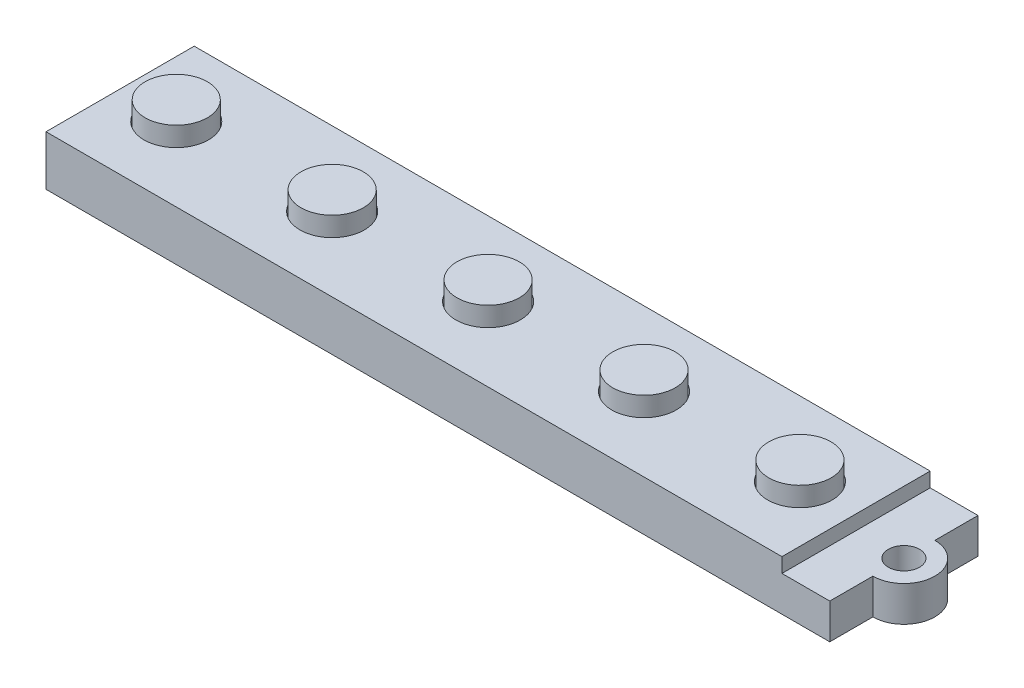
ISO-10303-21;
HEADER;
FILE_DESCRIPTION(('STEP AP214'),'2;1');
FILE_NAME('part.step','',(''),(''),'','','');
FILE_SCHEMA(('AUTOMOTIVE_DESIGN { 1 0 10303 214 1 1 1 1 }'));
ENDSEC;
DATA;
#1=APPLICATION_CONTEXT('core data for automotive mechanical design processes');
#2=APPLICATION_PROTOCOL_DEFINITION('international standard','automotive_design',2000,#1);
#3=PRODUCT_CONTEXT('',#1,'mechanical');
#4=PRODUCT('Part','Part','',(#3));
#5=PRODUCT_RELATED_PRODUCT_CATEGORY('part','',(#4));
#6=PRODUCT_DEFINITION_FORMATION('','',#4);
#7=PRODUCT_DEFINITION_CONTEXT('part definition',#1,'design');
#8=PRODUCT_DEFINITION('design','',#6,#7);
#9=PRODUCT_DEFINITION_SHAPE('','',#8);
#10=(LENGTH_UNIT() NAMED_UNIT(*) SI_UNIT(.MILLI.,.METRE.));
#11=(NAMED_UNIT(*) PLANE_ANGLE_UNIT() SI_UNIT($,.RADIAN.));
#12=(NAMED_UNIT(*) SI_UNIT($,.STERADIAN.) SOLID_ANGLE_UNIT());
#13=UNCERTAINTY_MEASURE_WITH_UNIT(LENGTH_MEASURE(1.E-05),#10,'distance_accuracy_value','');
#14=(GEOMETRIC_REPRESENTATION_CONTEXT(3) GLOBAL_UNCERTAINTY_ASSIGNED_CONTEXT((#13)) GLOBAL_UNIT_ASSIGNED_CONTEXT((#10,
#11,#12)) REPRESENTATION_CONTEXT('',''));
#15=CARTESIAN_POINT('',(0.,0.,0.));
#16=DIRECTION('',(0.,0.,1.));
#17=DIRECTION('',(1.,0.,0.));
#18=AXIS2_PLACEMENT_3D('',#15,#16,#17);
#19=CARTESIAN_POINT('',(0.,0.,0.));
#20=DIRECTION('',(0.,1.,0.));
#21=DIRECTION('',(0.,0.,1.));
#22=AXIS2_PLACEMENT_3D('',#19,#20,#21);
#23=PLANE('',#22);
#24=CARTESIAN_POINT('',(-20.4046666666667,0.,-25.8942737373737));
#25=DIRECTION('',(0.,1.,0.));
#26=DIRECTION('',(0.,0.,1.));
#27=AXIS2_PLACEMENT_3D('',#24,#25,#26);
#28=CIRCLE('',#27,1.905);
#29=CARTESIAN_POINT('',(-20.4046666666667,0.,-23.9892737373737));
#30=VERTEX_POINT('',#29);
#31=EDGE_CURVE('E223',#30,#30,#28,.T.);
#32=ORIENTED_EDGE('',*,*,#31,.T.);
#33=EDGE_LOOP('',(#32));
#34=FACE_BOUND('',#33,.T.);
#35=DIRECTION('',(0.,0.,-1.));
#36=VECTOR('',#35,1.);
#37=CARTESIAN_POINT('',(-112.479666666667,0.,-32.2442737373737));
#38=LINE('',#37,#36);
#39=CARTESIAN_POINT('',(-112.479666666667,0.,-19.5442737373737));
#40=VERTEX_POINT('',#39);
#41=CARTESIAN_POINT('',(-112.479666666667,0.,-32.2442737373737));
#42=VERTEX_POINT('',#41);
#43=EDGE_CURVE('E162',#40,#42,#38,.T.);
#44=ORIENTED_EDGE('',*,*,#43,.F.);
#45=DIRECTION('',(-1.,0.,0.));
#46=VECTOR('',#45,1.);
#47=CARTESIAN_POINT('',(-29.9296666666666,0.,-19.5442737373737));
#48=LINE('',#47,#46);
#49=CARTESIAN_POINT('',(-29.9296666666666,0.,-19.5442737373737));
#50=VERTEX_POINT('',#49);
#51=EDGE_CURVE('E167',#50,#40,#48,.T.);
#52=ORIENTED_EDGE('',*,*,#51,.F.);
#53=DIRECTION('',(0.,0.,1.));
#54=VECTOR('',#53,1.);
#55=CARTESIAN_POINT('',(-29.9296666666666,0.,-32.2442737373737));
#56=LINE('',#55,#54);
#57=CARTESIAN_POINT('',(-29.9296666666666,0.,-32.2442737373737));
#58=VERTEX_POINT('',#57);
#59=EDGE_CURVE('E177',#58,#50,#56,.T.);
#60=ORIENTED_EDGE('',*,*,#59,.F.);
#61=DIRECTION('',(1.,0.,0.));
#62=VECTOR('',#61,1.);
#63=CARTESIAN_POINT('',(-29.9296666666666,0.,-32.2442737373737));
#64=LINE('',#63,#62);
#65=EDGE_CURVE('E60',#42,#58,#64,.T.);
#66=ORIENTED_EDGE('',*,*,#65,.F.);
#67=EDGE_LOOP('',(#44,#52,#60,#66));
#68=FACE_BOUND('',#67,.T.);
#69=DIRECTION('',(-1.,0.,0.));
#70=VECTOR('',#69,1.);
#71=CARTESIAN_POINT('',(-116.162666666667,0.,-34.9493737373737));
#72=LINE('',#71,#70);
#73=CARTESIAN_POINT('',(-20.4046666666667,0.,-34.9493737373737));
#74=VERTEX_POINT('',#73);
#75=CARTESIAN_POINT('',(-116.162666666667,0.,-34.9493737373737));
#76=VERTEX_POINT('',#75);
#77=EDGE_CURVE('E245',#74,#76,#72,.T.);
#78=ORIENTED_EDGE('',*,*,#77,.F.);
#79=DIRECTION('',(0.,0.,1.));
#80=VECTOR('',#79,1.);
#81=CARTESIAN_POINT('',(-20.4046666666667,0.,0.));
#82=LINE('',#81,#80);
#83=CARTESIAN_POINT('',(-20.4046666666667,0.,-29.6800450522713));
#84=VERTEX_POINT('',#83);
#85=EDGE_CURVE('E159',#74,#84,#82,.T.);
#86=ORIENTED_EDGE('',*,*,#85,.T.);
#87=CARTESIAN_POINT('',(-20.4046666666667,0.,-25.8942737373737));
#88=DIRECTION('',(0.,1.,0.));
#89=DIRECTION('',(0.,0.,1.));
#90=AXIS2_PLACEMENT_3D('',#87,#88,#89);
#91=CIRCLE('',#90,3.78577131489756);
#92=CARTESIAN_POINT('',(-20.4046666666667,0.,-22.1085024224762));
#93=VERTEX_POINT('',#92);
#94=EDGE_CURVE('E155',#84,#93,#91,.F.);
#95=ORIENTED_EDGE('',*,*,#94,.T.);
#96=DIRECTION('',(0.,0.,1.));
#97=VECTOR('',#96,1.);
#98=CARTESIAN_POINT('',(-20.4046666666666,0.,0.));
#99=LINE('',#98,#97);
#100=CARTESIAN_POINT('',(-20.4046666666666,0.,-16.8391737373737));
#101=VERTEX_POINT('',#100);
#102=EDGE_CURVE('E133',#93,#101,#99,.T.);
#103=ORIENTED_EDGE('',*,*,#102,.T.);
#104=DIRECTION('',(1.,0.,0.));
#105=VECTOR('',#104,1.);
#106=CARTESIAN_POINT('',(-116.162666666667,0.,-16.8391737373737));
#107=LINE('',#106,#105);
#108=CARTESIAN_POINT('',(-116.162666666667,0.,-16.8391737373737));
#109=VERTEX_POINT('',#108);
#110=EDGE_CURVE('E252',#109,#101,#107,.T.);
#111=ORIENTED_EDGE('',*,*,#110,.F.);
#112=DIRECTION('',(0.,0.,1.));
#113=VECTOR('',#112,1.);
#114=CARTESIAN_POINT('',(-116.162666666667,0.,-34.9493737373737));
#115=LINE('',#114,#113);
#116=EDGE_CURVE('E238',#76,#109,#115,.T.);
#117=ORIENTED_EDGE('',*,*,#116,.F.);
#118=EDGE_LOOP('',(#78,#86,#95,#103,#111,#117));
#119=FACE_BOUND('',#118,.T.);
#120=ADVANCED_FACE('F37',(#34,#68,#119),#23,.F.);
#121=CARTESIAN_POINT('',(0.,4.318,0.));
#122=DIRECTION('',(0.,1.,0.));
#123=DIRECTION('',(0.,0.,1.));
#124=AXIS2_PLACEMENT_3D('',#121,#122,#123);
#125=PLANE('',#124);
#126=CARTESIAN_POINT('',(-20.4046666666667,4.318,-25.8942737373737));
#127=DIRECTION('',(0.,1.,0.));
#128=DIRECTION('',(0.,0.,1.));
#129=AXIS2_PLACEMENT_3D('',#126,#127,#128);
#130=CIRCLE('',#129,1.905);
#131=CARTESIAN_POINT('',(-20.4046666666667,4.318,-23.9892737373737));
#132=VERTEX_POINT('',#131);
#133=EDGE_CURVE('E220',#132,#132,#130,.T.);
#134=ORIENTED_EDGE('',*,*,#133,.F.);
#135=EDGE_LOOP('',(#134));
#136=FACE_BOUND('',#135,.T.);
#137=DIRECTION('',(0.,0.,1.));
#138=VECTOR('',#137,1.);
#139=CARTESIAN_POINT('',(-20.4046666666667,4.318,-34.9493737373737));
#140=LINE('',#139,#138);
#141=CARTESIAN_POINT('',(-20.4046666666667,4.318,-34.9493737373737));
#142=VERTEX_POINT('',#141);
#143=CARTESIAN_POINT('',(-20.4046666666667,4.318,-29.6800450522713));
#144=VERTEX_POINT('',#143);
#145=EDGE_CURVE('E52',#142,#144,#140,.T.);
#146=ORIENTED_EDGE('',*,*,#145,.F.);
#147=DIRECTION('',(-1.,0.,0.));
#148=VECTOR('',#147,1.);
#149=CARTESIAN_POINT('',(-26.2466666666667,4.318,-34.9493737373737));
#150=LINE('',#149,#148);
#151=CARTESIAN_POINT('',(-26.2466666666667,4.318,-34.9493737373737));
#152=VERTEX_POINT('',#151);
#153=EDGE_CURVE('E232',#142,#152,#150,.T.);
#154=ORIENTED_EDGE('',*,*,#153,.T.);
#155=DIRECTION('',(0.,0.,1.));
#156=VECTOR('',#155,1.);
#157=CARTESIAN_POINT('',(-26.2466666666667,4.318,-34.9493737373737));
#158=LINE('',#157,#156);
#159=CARTESIAN_POINT('',(-26.2466666666667,4.318,-16.8391737373737));
#160=VERTEX_POINT('',#159);
#161=EDGE_CURVE('E229',#152,#160,#158,.T.);
#162=ORIENTED_EDGE('',*,*,#161,.T.);
#163=DIRECTION('',(1.,0.,0.));
#164=VECTOR('',#163,1.);
#165=CARTESIAN_POINT('',(-26.2466666666667,4.318,-16.8391737373737));
#166=LINE('',#165,#164);
#167=CARTESIAN_POINT('',(-20.4046666666666,4.318,-16.8391737373737));
#168=VERTEX_POINT('',#167);
#169=EDGE_CURVE('E148',#160,#168,#166,.T.);
#170=ORIENTED_EDGE('',*,*,#169,.T.);
#171=DIRECTION('',(0.,0.,1.));
#172=VECTOR('',#171,1.);
#173=CARTESIAN_POINT('',(-20.4046666666667,4.318,-22.1085024224762));
#174=LINE('',#173,#172);
#175=CARTESIAN_POINT('',(-20.4046666666667,4.318,-22.1085024224762));
#176=VERTEX_POINT('',#175);
#177=EDGE_CURVE('E130',#176,#168,#174,.T.);
#178=ORIENTED_EDGE('',*,*,#177,.F.);
#179=CARTESIAN_POINT('',(-20.4046666666667,4.318,-25.8942737373737));
#180=DIRECTION('',(0.,-1.,0.));
#181=DIRECTION('',(0.,0.,1.));
#182=AXIS2_PLACEMENT_3D('',#179,#180,#181);
#183=CIRCLE('',#182,3.78577131489756);
#184=EDGE_CURVE('E140',#144,#176,#183,.T.);
#185=ORIENTED_EDGE('',*,*,#184,.F.);
#186=EDGE_LOOP('',(#146,#154,#162,#170,#178,#185));
#187=FACE_BOUND('',#186,.T.);
#188=ADVANCED_FACE('F145',(#136,#187),#125,.T.);
#189=CARTESIAN_POINT('',(-116.162666666667,6.096,-34.9493737373737));
#190=DIRECTION('',(1.,0.,0.));
#191=DIRECTION('',(0.,0.,-1.));
#192=AXIS2_PLACEMENT_3D('',#189,#190,#191);
#193=PLANE('',#192);
#194=ORIENTED_EDGE('',*,*,#116,.T.);
#195=DIRECTION('',(0.,-1.,0.));
#196=VECTOR('',#195,1.);
#197=CARTESIAN_POINT('',(-116.162666666667,6.096,-16.8391737373737));
#198=LINE('',#197,#196);
#199=CARTESIAN_POINT('',(-116.162666666667,6.096,-16.8391737373737));
#200=VERTEX_POINT('',#199);
#201=EDGE_CURVE('E11',#200,#109,#198,.T.);
#202=ORIENTED_EDGE('',*,*,#201,.F.);
#203=DIRECTION('',(0.,0.,1.));
#204=VECTOR('',#203,1.);
#205=CARTESIAN_POINT('',(-116.162666666667,6.096,-34.9493737373737));
#206=LINE('',#205,#204);
#207=CARTESIAN_POINT('',(-116.162666666667,6.096,-34.9493737373737));
#208=VERTEX_POINT('',#207);
#209=EDGE_CURVE('E241',#208,#200,#206,.T.);
#210=ORIENTED_EDGE('',*,*,#209,.F.);
#211=DIRECTION('',(0.,-1.,0.));
#212=VECTOR('',#211,1.);
#213=CARTESIAN_POINT('',(-116.162666666667,6.096,-34.9493737373737));
#214=LINE('',#213,#212);
#215=EDGE_CURVE('E45',#208,#76,#214,.T.);
#216=ORIENTED_EDGE('',*,*,#215,.T.);
#217=EDGE_LOOP('',(#194,#202,#210,#216));
#218=FACE_BOUND('',#217,.T.);
#219=ADVANCED_FACE('F39',(#218),#193,.F.);
#220=CARTESIAN_POINT('',(-116.162666666667,6.096,-16.8391737373737));
#221=DIRECTION('',(0.,0.,-1.));
#222=DIRECTION('',(-1.,0.,0.));
#223=AXIS2_PLACEMENT_3D('',#220,#221,#222);
#224=PLANE('',#223);
#225=ORIENTED_EDGE('',*,*,#110,.T.);
#226=DIRECTION('',(0.,1.,0.));
#227=VECTOR('',#226,1.);
#228=CARTESIAN_POINT('',(-20.4046666666666,-1.27,-16.8391737373737));
#229=LINE('',#228,#227);
#230=EDGE_CURVE('E136',#101,#168,#229,.T.);
#231=ORIENTED_EDGE('',*,*,#230,.T.);
#232=ORIENTED_EDGE('',*,*,#169,.F.);
#233=DIRECTION('',(0.,1.,0.));
#234=VECTOR('',#233,1.);
#235=CARTESIAN_POINT('',(-26.2466666666667,4.318,-16.8391737373737));
#236=LINE('',#235,#234);
#237=CARTESIAN_POINT('',(-26.2466666666667,6.096,-16.8391737373737));
#238=VERTEX_POINT('',#237);
#239=EDGE_CURVE('E234',#160,#238,#236,.T.);
#240=ORIENTED_EDGE('',*,*,#239,.T.);
#241=DIRECTION('',(1.,0.,0.));
#242=VECTOR('',#241,1.);
#243=CARTESIAN_POINT('',(-116.162666666667,6.096,-16.8391737373737));
#244=LINE('',#243,#242);
#245=EDGE_CURVE('E244',#200,#238,#244,.T.);
#246=ORIENTED_EDGE('',*,*,#245,.F.);
#247=ORIENTED_EDGE('',*,*,#201,.T.);
#248=EDGE_LOOP('',(#225,#231,#232,#240,#246,#247));
#249=FACE_BOUND('',#248,.T.);
#250=ADVANCED_FACE('F266',(#249),#224,.F.);
#251=CARTESIAN_POINT('',(-116.162666666667,6.096,-34.9493737373737));
#252=DIRECTION('',(0.,0.,1.));
#253=DIRECTION('',(1.,0.,0.));
#254=AXIS2_PLACEMENT_3D('',#251,#252,#253);
#255=PLANE('',#254);
#256=ORIENTED_EDGE('',*,*,#153,.F.);
#257=DIRECTION('',(0.,1.,0.));
#258=VECTOR('',#257,1.);
#259=CARTESIAN_POINT('',(-20.4046666666667,-1.27,-34.9493737373737));
#260=LINE('',#259,#258);
#261=EDGE_CURVE('E153',#74,#142,#260,.T.);
#262=ORIENTED_EDGE('',*,*,#261,.F.);
#263=ORIENTED_EDGE('',*,*,#77,.T.);
#264=ORIENTED_EDGE('',*,*,#215,.F.);
#265=DIRECTION('',(-1.,0.,0.));
#266=VECTOR('',#265,1.);
#267=CARTESIAN_POINT('',(-116.162666666667,6.096,-34.9493737373737));
#268=LINE('',#267,#266);
#269=CARTESIAN_POINT('',(-26.2466666666667,6.096,-34.9493737373737));
#270=VERTEX_POINT('',#269);
#271=EDGE_CURVE('E248',#270,#208,#268,.T.);
#272=ORIENTED_EDGE('',*,*,#271,.F.);
#273=DIRECTION('',(0.,1.,0.));
#274=VECTOR('',#273,1.);
#275=CARTESIAN_POINT('',(-26.2466666666667,4.318,-34.9493737373737));
#276=LINE('',#275,#274);
#277=EDGE_CURVE('E236',#152,#270,#276,.T.);
#278=ORIENTED_EDGE('',*,*,#277,.F.);
#279=EDGE_LOOP('',(#256,#262,#263,#264,#272,#278));
#280=FACE_BOUND('',#279,.T.);
#281=ADVANCED_FACE('F272',(#280),#255,.F.);
#282=CARTESIAN_POINT('',(0.,6.096,0.));
#283=DIRECTION('',(0.,1.,0.));
#284=DIRECTION('',(0.,0.,1.));
#285=AXIS2_PLACEMENT_3D('',#282,#283,#284);
#286=PLANE('',#285);
#287=CARTESIAN_POINT('',(-52.1546666666667,6.096,-25.8942737373736));
#288=DIRECTION('',(0.,1.,0.));
#289=DIRECTION('',(0.,0.,1.));
#290=AXIS2_PLACEMENT_3D('',#287,#288,#289);
#291=CIRCLE('',#290,3.937);
#292=CARTESIAN_POINT('',(-52.1546666666667,6.096,-21.9572737373736));
#293=VERTEX_POINT('',#292);
#294=EDGE_CURVE('E197',#293,#293,#291,.T.);
#295=ORIENTED_EDGE('',*,*,#294,.F.);
#296=EDGE_LOOP('',(#295));
#297=FACE_BOUND('',#296,.T.);
#298=CARTESIAN_POINT('',(-71.2046666666667,6.096,-25.8942737373734));
#299=DIRECTION('',(0.,1.,0.));
#300=DIRECTION('',(0.,0.,1.));
#301=AXIS2_PLACEMENT_3D('',#298,#299,#300);
#302=CIRCLE('',#301,3.937);
#303=CARTESIAN_POINT('',(-71.2046666666667,6.096,-21.9572737373734));
#304=VERTEX_POINT('',#303);
#305=EDGE_CURVE('E203',#304,#304,#302,.T.);
#306=ORIENTED_EDGE('',*,*,#305,.F.);
#307=EDGE_LOOP('',(#306));
#308=FACE_BOUND('',#307,.T.);
#309=CARTESIAN_POINT('',(-90.2546666666667,6.096,-25.8942737373733));
#310=DIRECTION('',(0.,1.,0.));
#311=DIRECTION('',(0.,0.,1.));
#312=AXIS2_PLACEMENT_3D('',#309,#310,#311);
#313=CIRCLE('',#312,3.937);
#314=CARTESIAN_POINT('',(-90.2546666666667,6.096,-21.9572737373733));
#315=VERTEX_POINT('',#314);
#316=EDGE_CURVE('E209',#315,#315,#313,.T.);
#317=ORIENTED_EDGE('',*,*,#316,.F.);
#318=EDGE_LOOP('',(#317));
#319=FACE_BOUND('',#318,.T.);
#320=CARTESIAN_POINT('',(-109.304666666667,6.096,-25.8942737373732));
#321=DIRECTION('',(0.,1.,0.));
#322=DIRECTION('',(0.,0.,1.));
#323=AXIS2_PLACEMENT_3D('',#320,#321,#322);
#324=CIRCLE('',#323,3.937);
#325=CARTESIAN_POINT('',(-109.304666666667,6.096,-21.9572737373732));
#326=VERTEX_POINT('',#325);
#327=EDGE_CURVE('E192',#326,#326,#324,.T.);
#328=ORIENTED_EDGE('',*,*,#327,.F.);
#329=EDGE_LOOP('',(#328));
#330=FACE_BOUND('',#329,.T.);
#331=CARTESIAN_POINT('',(-33.1046666666667,6.096,-25.8942737373737));
#332=DIRECTION('',(0.,1.,0.));
#333=DIRECTION('',(0.,0.,1.));
#334=AXIS2_PLACEMENT_3D('',#331,#332,#333);
#335=CIRCLE('',#334,3.937);
#336=CARTESIAN_POINT('',(-33.1046666666667,6.096,-21.9572737373737));
#337=VERTEX_POINT('',#336);
#338=EDGE_CURVE('E196',#337,#337,#335,.T.);
#339=ORIENTED_EDGE('',*,*,#338,.F.);
#340=EDGE_LOOP('',(#339));
#341=FACE_BOUND('',#340,.T.);
#342=DIRECTION('',(0.,0.,1.));
#343=VECTOR('',#342,1.);
#344=CARTESIAN_POINT('',(-26.2466666666667,6.096,-34.9493737373737));
#345=LINE('',#344,#343);
#346=EDGE_CURVE('E226',#270,#238,#345,.T.);
#347=ORIENTED_EDGE('',*,*,#346,.F.);
#348=ORIENTED_EDGE('',*,*,#271,.T.);
#349=ORIENTED_EDGE('',*,*,#209,.T.);
#350=ORIENTED_EDGE('',*,*,#245,.T.);
#351=EDGE_LOOP('',(#347,#348,#349,#350));
#352=FACE_BOUND('',#351,.T.);
#353=ADVANCED_FACE('F269',(#297,#308,#319,#330,#341,#352),#286,.T.);
#354=CARTESIAN_POINT('',(-26.2466666666667,4.318,-34.9493737373737));
#355=DIRECTION('',(-1.,0.,0.));
#356=DIRECTION('',(0.,0.,1.));
#357=AXIS2_PLACEMENT_3D('',#354,#355,#356);
#358=PLANE('',#357);
#359=ORIENTED_EDGE('',*,*,#346,.T.);
#360=ORIENTED_EDGE('',*,*,#239,.F.);
#361=ORIENTED_EDGE('',*,*,#161,.F.);
#362=ORIENTED_EDGE('',*,*,#277,.T.);
#363=EDGE_LOOP('',(#359,#360,#361,#362));
#364=FACE_BOUND('',#363,.T.);
#365=ADVANCED_FACE('F276',(#364),#358,.F.);
#366=CARTESIAN_POINT('',(-20.4046666666667,0.,-25.8942737373737));
#367=DIRECTION('',(0.,1.,0.));
#368=DIRECTION('',(0.,0.,1.));
#369=AXIS2_PLACEMENT_3D('',#366,#367,#368);
#370=CYLINDRICAL_SURFACE('',#369,1.905);
#371=ORIENTED_EDGE('',*,*,#31,.F.);
#372=EDGE_LOOP('',(#371));
#373=FACE_BOUND('',#372,.T.);
#374=ORIENTED_EDGE('',*,*,#133,.T.);
#375=EDGE_LOOP('',(#374));
#376=FACE_BOUND('',#375,.T.);
#377=ADVANCED_FACE('F340',(#373,#376),#370,.F.);
#378=CARTESIAN_POINT('',(-33.1046666666667,4.826,-25.8942737373737));
#379=DIRECTION('',(0.,1.,0.));
#380=DIRECTION('',(0.,0.,1.));
#381=AXIS2_PLACEMENT_3D('',#378,#379,#380);
#382=CYLINDRICAL_SURFACE('',#381,3.937);
#383=CARTESIAN_POINT('',(-33.1046666666667,4.826,-25.8942737373737));
#384=DIRECTION('',(0.,1.,0.));
#385=DIRECTION('',(0.,0.,1.));
#386=AXIS2_PLACEMENT_3D('',#383,#384,#385);
#387=CIRCLE('',#386,3.937);
#388=CARTESIAN_POINT('',(-33.1046666666667,4.826,-21.9572737373737));
#389=VERTEX_POINT('',#388);
#390=EDGE_CURVE('E217',#389,#389,#387,.T.);
#391=ORIENTED_EDGE('',*,*,#390,.F.);
#392=EDGE_LOOP('',(#391));
#393=FACE_BOUND('',#392,.T.);
#394=ORIENTED_EDGE('',*,*,#338,.T.);
#395=EDGE_LOOP('',(#394));
#396=FACE_BOUND('',#395,.T.);
#397=ADVANCED_FACE('F338',(#393,#396),#382,.F.);
#398=CARTESIAN_POINT('',(-33.1046666666667,4.826,-25.8942737373737));
#399=DIRECTION('',(0.,1.,0.));
#400=DIRECTION('',(0.,0.,1.));
#401=AXIS2_PLACEMENT_3D('',#398,#399,#400);
#402=PLANE('',#401);
#403=CARTESIAN_POINT('',(-33.1046666666667,4.826,-25.8942737373737));
#404=DIRECTION('',(0.,1.,0.));
#405=DIRECTION('',(0.,0.,1.));
#406=AXIS2_PLACEMENT_3D('',#403,#404,#405);
#407=CIRCLE('',#406,3.81);
#408=CARTESIAN_POINT('',(-33.1046666666667,4.826,-22.0842737373737));
#409=VERTEX_POINT('',#408);
#410=EDGE_CURVE('E279',#409,#409,#407,.T.);
#411=ORIENTED_EDGE('',*,*,#410,.F.);
#412=EDGE_LOOP('',(#411));
#413=FACE_BOUND('',#412,.T.);
#414=ORIENTED_EDGE('',*,*,#390,.T.);
#415=EDGE_LOOP('',(#414));
#416=FACE_BOUND('',#415,.T.);
#417=ADVANCED_FACE('F328',(#413,#416),#402,.T.);
#418=CARTESIAN_POINT('',(-109.304666666667,4.826,-25.8942737373732));
#419=DIRECTION('',(0.,1.,0.));
#420=DIRECTION('',(0.,0.,1.));
#421=AXIS2_PLACEMENT_3D('',#418,#419,#420);
#422=CYLINDRICAL_SURFACE('',#421,3.937);
#423=CARTESIAN_POINT('',(-109.304666666667,4.826,-25.8942737373732));
#424=DIRECTION('',(0.,1.,0.));
#425=DIRECTION('',(0.,0.,1.));
#426=AXIS2_PLACEMENT_3D('',#423,#424,#425);
#427=CIRCLE('',#426,3.937);
#428=CARTESIAN_POINT('',(-109.304666666667,4.826,-21.9572737373732));
#429=VERTEX_POINT('',#428);
#430=EDGE_CURVE('E212',#429,#429,#427,.T.);
#431=ORIENTED_EDGE('',*,*,#430,.F.);
#432=EDGE_LOOP('',(#431));
#433=FACE_BOUND('',#432,.T.);
#434=ORIENTED_EDGE('',*,*,#327,.T.);
#435=EDGE_LOOP('',(#434));
#436=FACE_BOUND('',#435,.T.);
#437=ADVANCED_FACE('F322',(#433,#436),#422,.F.);
#438=CARTESIAN_POINT('',(-109.304666666667,4.826,-25.8942737373732));
#439=DIRECTION('',(0.,1.,0.));
#440=DIRECTION('',(0.,0.,1.));
#441=AXIS2_PLACEMENT_3D('',#438,#439,#440);
#442=PLANE('',#441);
#443=CARTESIAN_POINT('',(-109.304666666667,4.826,-25.8942737373732));
#444=DIRECTION('',(0.,1.,0.));
#445=DIRECTION('',(0.,0.,1.));
#446=AXIS2_PLACEMENT_3D('',#443,#444,#445);
#447=CIRCLE('',#446,3.81);
#448=CARTESIAN_POINT('',(-109.304666666667,4.826,-22.0842737373732));
#449=VERTEX_POINT('',#448);
#450=EDGE_CURVE('E303',#449,#449,#447,.T.);
#451=ORIENTED_EDGE('',*,*,#450,.F.);
#452=EDGE_LOOP('',(#451));
#453=FACE_BOUND('',#452,.T.);
#454=ORIENTED_EDGE('',*,*,#430,.T.);
#455=EDGE_LOOP('',(#454));
#456=FACE_BOUND('',#455,.T.);
#457=ADVANCED_FACE('F318',(#453,#456),#442,.T.);
#458=CARTESIAN_POINT('',(-90.2546666666667,4.826,-25.8942737373733));
#459=DIRECTION('',(0.,1.,0.));
#460=DIRECTION('',(0.,0.,1.));
#461=AXIS2_PLACEMENT_3D('',#458,#459,#460);
#462=CYLINDRICAL_SURFACE('',#461,3.937);
#463=CARTESIAN_POINT('',(-90.2546666666667,4.826,-25.8942737373733));
#464=DIRECTION('',(0.,1.,0.));
#465=DIRECTION('',(0.,0.,1.));
#466=AXIS2_PLACEMENT_3D('',#463,#464,#465);
#467=CIRCLE('',#466,3.937);
#468=CARTESIAN_POINT('',(-90.2546666666667,4.826,-21.9572737373733));
#469=VERTEX_POINT('',#468);
#470=EDGE_CURVE('E206',#469,#469,#467,.T.);
#471=ORIENTED_EDGE('',*,*,#470,.F.);
#472=EDGE_LOOP('',(#471));
#473=FACE_BOUND('',#472,.T.);
#474=ORIENTED_EDGE('',*,*,#316,.T.);
#475=EDGE_LOOP('',(#474));
#476=FACE_BOUND('',#475,.T.);
#477=ADVANCED_FACE('F321',(#473,#476),#462,.F.);
#478=CARTESIAN_POINT('',(-90.2546666666667,4.826,-25.8942737373733));
#479=DIRECTION('',(0.,1.,0.));
#480=DIRECTION('',(0.,0.,1.));
#481=AXIS2_PLACEMENT_3D('',#478,#479,#480);
#482=PLANE('',#481);
#483=CARTESIAN_POINT('',(-90.2546666666667,4.826,-25.8942737373733));
#484=DIRECTION('',(0.,1.,0.));
#485=DIRECTION('',(0.,0.,1.));
#486=AXIS2_PLACEMENT_3D('',#483,#484,#485);
#487=CIRCLE('',#486,3.81);
#488=CARTESIAN_POINT('',(-90.2546666666667,4.826,-22.0842737373733));
#489=VERTEX_POINT('',#488);
#490=EDGE_CURVE('E297',#489,#489,#487,.T.);
#491=ORIENTED_EDGE('',*,*,#490,.F.);
#492=EDGE_LOOP('',(#491));
#493=FACE_BOUND('',#492,.T.);
#494=ORIENTED_EDGE('',*,*,#470,.T.);
#495=EDGE_LOOP('',(#494));
#496=FACE_BOUND('',#495,.T.);
#497=ADVANCED_FACE('F466',(#493,#496),#482,.T.);
#498=CARTESIAN_POINT('',(-71.2046666666667,4.826,-25.8942737373734));
#499=DIRECTION('',(0.,1.,0.));
#500=DIRECTION('',(0.,0.,1.));
#501=AXIS2_PLACEMENT_3D('',#498,#499,#500);
#502=CYLINDRICAL_SURFACE('',#501,3.937);
#503=CARTESIAN_POINT('',(-71.2046666666667,4.826,-25.8942737373734));
#504=DIRECTION('',(0.,1.,0.));
#505=DIRECTION('',(0.,0.,1.));
#506=AXIS2_PLACEMENT_3D('',#503,#504,#505);
#507=CIRCLE('',#506,3.937);
#508=CARTESIAN_POINT('',(-71.2046666666667,4.826,-21.9572737373734));
#509=VERTEX_POINT('',#508);
#510=EDGE_CURVE('E200',#509,#509,#507,.T.);
#511=ORIENTED_EDGE('',*,*,#510,.F.);
#512=EDGE_LOOP('',(#511));
#513=FACE_BOUND('',#512,.T.);
#514=ORIENTED_EDGE('',*,*,#305,.T.);
#515=EDGE_LOOP('',(#514));
#516=FACE_BOUND('',#515,.T.);
#517=ADVANCED_FACE('F460',(#513,#516),#502,.F.);
#518=CARTESIAN_POINT('',(-71.2046666666667,4.826,-25.8942737373734));
#519=DIRECTION('',(0.,1.,0.));
#520=DIRECTION('',(0.,0.,1.));
#521=AXIS2_PLACEMENT_3D('',#518,#519,#520);
#522=PLANE('',#521);
#523=CARTESIAN_POINT('',(-71.2046666666667,4.826,-25.8942737373734));
#524=DIRECTION('',(0.,1.,0.));
#525=DIRECTION('',(0.,0.,1.));
#526=AXIS2_PLACEMENT_3D('',#523,#524,#525);
#527=CIRCLE('',#526,3.81000000000001);
#528=CARTESIAN_POINT('',(-71.2046666666667,4.826,-22.0842737373734));
#529=VERTEX_POINT('',#528);
#530=EDGE_CURVE('E291',#529,#529,#527,.T.);
#531=ORIENTED_EDGE('',*,*,#530,.F.);
#532=EDGE_LOOP('',(#531));
#533=FACE_BOUND('',#532,.T.);
#534=ORIENTED_EDGE('',*,*,#510,.T.);
#535=EDGE_LOOP('',(#534));
#536=FACE_BOUND('',#535,.T.);
#537=ADVANCED_FACE('F452',(#533,#536),#522,.T.);
#538=CARTESIAN_POINT('',(-52.1546666666667,4.826,-25.8942737373736));
#539=DIRECTION('',(0.,1.,0.));
#540=DIRECTION('',(0.,0.,1.));
#541=AXIS2_PLACEMENT_3D('',#538,#539,#540);
#542=CYLINDRICAL_SURFACE('',#541,3.937);
#543=CARTESIAN_POINT('',(-52.1546666666667,4.826,-25.8942737373736));
#544=DIRECTION('',(0.,1.,0.));
#545=DIRECTION('',(0.,0.,1.));
#546=AXIS2_PLACEMENT_3D('',#543,#544,#545);
#547=CIRCLE('',#546,3.937);
#548=CARTESIAN_POINT('',(-52.1546666666667,4.826,-21.9572737373736));
#549=VERTEX_POINT('',#548);
#550=EDGE_CURVE('E193',#549,#549,#547,.T.);
#551=ORIENTED_EDGE('',*,*,#550,.F.);
#552=EDGE_LOOP('',(#551));
#553=FACE_BOUND('',#552,.T.);
#554=ORIENTED_EDGE('',*,*,#294,.T.);
#555=EDGE_LOOP('',(#554));
#556=FACE_BOUND('',#555,.T.);
#557=ADVANCED_FACE('F446',(#553,#556),#542,.F.);
#558=CARTESIAN_POINT('',(-52.1546666666667,4.826,-25.8942737373736));
#559=DIRECTION('',(0.,1.,0.));
#560=DIRECTION('',(0.,0.,1.));
#561=AXIS2_PLACEMENT_3D('',#558,#559,#560);
#562=PLANE('',#561);
#563=CARTESIAN_POINT('',(-52.1546666666667,4.826,-25.8942737373736));
#564=DIRECTION('',(0.,1.,0.));
#565=DIRECTION('',(0.,0.,1.));
#566=AXIS2_PLACEMENT_3D('',#563,#564,#565);
#567=CIRCLE('',#566,3.81);
#568=CARTESIAN_POINT('',(-52.1546666666667,4.826,-22.0842737373736));
#569=VERTEX_POINT('',#568);
#570=EDGE_CURVE('E285',#569,#569,#567,.T.);
#571=ORIENTED_EDGE('',*,*,#570,.F.);
#572=EDGE_LOOP('',(#571));
#573=FACE_BOUND('',#572,.T.);
#574=ORIENTED_EDGE('',*,*,#550,.T.);
#575=EDGE_LOOP('',(#574));
#576=FACE_BOUND('',#575,.T.);
#577=ADVANCED_FACE('F438',(#573,#576),#562,.T.);
#578=CARTESIAN_POINT('',(-112.479666666667,-1.27,-32.2442737373737));
#579=DIRECTION('',(1.,0.,0.));
#580=DIRECTION('',(0.,0.,-1.));
#581=AXIS2_PLACEMENT_3D('',#578,#579,#580);
#582=PLANE('',#581);
#583=ORIENTED_EDGE('',*,*,#43,.T.);
#584=DIRECTION('',(0.,1.,0.));
#585=VECTOR('',#584,1.);
#586=CARTESIAN_POINT('',(-112.479666666667,-1.27,-32.2442737373737));
#587=LINE('',#586,#585);
#588=CARTESIAN_POINT('',(-112.479666666667,-1.27,-32.2442737373737));
#589=VERTEX_POINT('',#588);
#590=EDGE_CURVE('E190',#589,#42,#587,.T.);
#591=ORIENTED_EDGE('',*,*,#590,.F.);
#592=DIRECTION('',(0.,0.,-1.));
#593=VECTOR('',#592,1.);
#594=CARTESIAN_POINT('',(-112.479666666667,-1.27,-32.2442737373737));
#595=LINE('',#594,#593);
#596=CARTESIAN_POINT('',(-112.479666666667,-1.27,-19.5442737373737));
#597=VERTEX_POINT('',#596);
#598=EDGE_CURVE('E163',#597,#589,#595,.T.);
#599=ORIENTED_EDGE('',*,*,#598,.F.);
#600=DIRECTION('',(0.,1.,0.));
#601=VECTOR('',#600,1.);
#602=CARTESIAN_POINT('',(-112.479666666667,-1.27,-19.5442737373737));
#603=LINE('',#602,#601);
#604=EDGE_CURVE('E173',#597,#40,#603,.T.);
#605=ORIENTED_EDGE('',*,*,#604,.T.);
#606=EDGE_LOOP('',(#583,#591,#599,#605));
#607=FACE_BOUND('',#606,.T.);
#608=ADVANCED_FACE('F427',(#607),#582,.F.);
#609=CARTESIAN_POINT('',(-29.9296666666666,-1.27,-32.2442737373737));
#610=DIRECTION('',(0.,0.,1.));
#611=DIRECTION('',(1.,0.,0.));
#612=AXIS2_PLACEMENT_3D('',#609,#610,#611);
#613=PLANE('',#612);
#614=ORIENTED_EDGE('',*,*,#65,.T.);
#615=DIRECTION('',(0.,1.,0.));
#616=VECTOR('',#615,1.);
#617=CARTESIAN_POINT('',(-29.9296666666666,-1.27,-32.2442737373737));
#618=LINE('',#617,#616);
#619=CARTESIAN_POINT('',(-29.9296666666666,-1.27,-32.2442737373737));
#620=VERTEX_POINT('',#619);
#621=EDGE_CURVE('E187',#620,#58,#618,.T.);
#622=ORIENTED_EDGE('',*,*,#621,.F.);
#623=DIRECTION('',(1.,0.,0.));
#624=VECTOR('',#623,1.);
#625=CARTESIAN_POINT('',(-29.9296666666666,-1.27,-32.2442737373737));
#626=LINE('',#625,#624);
#627=EDGE_CURVE('E166',#589,#620,#626,.T.);
#628=ORIENTED_EDGE('',*,*,#627,.F.);
#629=ORIENTED_EDGE('',*,*,#590,.T.);
#630=EDGE_LOOP('',(#614,#622,#628,#629));
#631=FACE_BOUND('',#630,.T.);
#632=ADVANCED_FACE('F416',(#631),#613,.F.);
#633=CARTESIAN_POINT('',(-29.9296666666666,-1.27,-32.2442737373737));
#634=DIRECTION('',(-1.,0.,0.));
#635=DIRECTION('',(0.,0.,1.));
#636=AXIS2_PLACEMENT_3D('',#633,#634,#635);
#637=PLANE('',#636);
#638=ORIENTED_EDGE('',*,*,#59,.T.);
#639=DIRECTION('',(0.,1.,0.));
#640=VECTOR('',#639,1.);
#641=CARTESIAN_POINT('',(-29.9296666666666,-1.27,-19.5442737373737));
#642=LINE('',#641,#640);
#643=CARTESIAN_POINT('',(-29.9296666666666,-1.27,-19.5442737373737));
#644=VERTEX_POINT('',#643);
#645=EDGE_CURVE('E184',#644,#50,#642,.T.);
#646=ORIENTED_EDGE('',*,*,#645,.F.);
#647=DIRECTION('',(0.,0.,1.));
#648=VECTOR('',#647,1.);
#649=CARTESIAN_POINT('',(-29.9296666666666,-1.27,-32.2442737373737));
#650=LINE('',#649,#648);
#651=EDGE_CURVE('E169',#620,#644,#650,.T.);
#652=ORIENTED_EDGE('',*,*,#651,.F.);
#653=ORIENTED_EDGE('',*,*,#621,.T.);
#654=EDGE_LOOP('',(#638,#646,#652,#653));
#655=FACE_BOUND('',#654,.T.);
#656=ADVANCED_FACE('F405',(#655),#637,.F.);
#657=CARTESIAN_POINT('',(-29.9296666666666,-1.27,-19.5442737373737));
#658=DIRECTION('',(0.,0.,-1.));
#659=DIRECTION('',(-1.,0.,0.));
#660=AXIS2_PLACEMENT_3D('',#657,#658,#659);
#661=PLANE('',#660);
#662=ORIENTED_EDGE('',*,*,#51,.T.);
#663=ORIENTED_EDGE('',*,*,#604,.F.);
#664=DIRECTION('',(-1.,0.,0.));
#665=VECTOR('',#664,1.);
#666=CARTESIAN_POINT('',(-29.9296666666666,-1.27,-19.5442737373737));
#667=LINE('',#666,#665);
#668=EDGE_CURVE('E171',#644,#597,#667,.T.);
#669=ORIENTED_EDGE('',*,*,#668,.F.);
#670=ORIENTED_EDGE('',*,*,#645,.T.);
#671=EDGE_LOOP('',(#662,#663,#669,#670));
#672=FACE_BOUND('',#671,.T.);
#673=ADVANCED_FACE('F393',(#672),#661,.F.);
#674=CARTESIAN_POINT('',(0.,-1.27,0.));
#675=DIRECTION('',(0.,-1.,0.));
#676=DIRECTION('',(0.,0.,-1.));
#677=AXIS2_PLACEMENT_3D('',#674,#675,#676);
#678=PLANE('',#677);
#679=ORIENTED_EDGE('',*,*,#598,.T.);
#680=ORIENTED_EDGE('',*,*,#627,.T.);
#681=ORIENTED_EDGE('',*,*,#651,.T.);
#682=ORIENTED_EDGE('',*,*,#668,.T.);
#683=EDGE_LOOP('',(#679,#680,#681,#682));
#684=FACE_BOUND('',#683,.T.);
#685=ADVANCED_FACE('F386',(#684),#678,.T.);
#686=CARTESIAN_POINT('',(-20.4046666666667,-1.27,-34.9493737373737));
#687=DIRECTION('',(-1.,0.,0.));
#688=DIRECTION('',(0.,0.,1.));
#689=AXIS2_PLACEMENT_3D('',#686,#687,#688);
#690=PLANE('',#689);
#691=ORIENTED_EDGE('',*,*,#261,.T.);
#692=ORIENTED_EDGE('',*,*,#145,.T.);
#693=DIRECTION('',(0.,1.,0.));
#694=VECTOR('',#693,1.);
#695=CARTESIAN_POINT('',(-20.4046666666667,-1.27,-29.6800450522713));
#696=LINE('',#695,#694);
#697=EDGE_CURVE('E137',#84,#144,#696,.T.);
#698=ORIENTED_EDGE('',*,*,#697,.F.);
#699=ORIENTED_EDGE('',*,*,#85,.F.);
#700=EDGE_LOOP('',(#691,#692,#698,#699));
#701=FACE_BOUND('',#700,.T.);
#702=ADVANCED_FACE('F392',(#701),#690,.F.);
#703=CARTESIAN_POINT('',(-20.4046666666667,-1.27,-22.1085024224762));
#704=DIRECTION('',(-1.,0.,0.));
#705=DIRECTION('',(0.,0.,1.));
#706=AXIS2_PLACEMENT_3D('',#703,#704,#705);
#707=PLANE('',#706);
#708=DIRECTION('',(0.,1.,0.));
#709=VECTOR('',#708,1.);
#710=CARTESIAN_POINT('',(-20.4046666666667,-1.27,-22.1085024224762));
#711=LINE('',#710,#709);
#712=EDGE_CURVE('E126',#93,#176,#711,.T.);
#713=ORIENTED_EDGE('',*,*,#712,.T.);
#714=ORIENTED_EDGE('',*,*,#177,.T.);
#715=ORIENTED_EDGE('',*,*,#230,.F.);
#716=ORIENTED_EDGE('',*,*,#102,.F.);
#717=EDGE_LOOP('',(#713,#714,#715,#716));
#718=FACE_BOUND('',#717,.T.);
#719=ADVANCED_FACE('F128',(#718),#707,.F.);
#720=CARTESIAN_POINT('',(-20.4046666666667,-1.27,-25.8942737373737));
#721=DIRECTION('',(0.,1.,0.));
#722=DIRECTION('',(0.,0.,1.));
#723=AXIS2_PLACEMENT_3D('',#720,#721,#722);
#724=CYLINDRICAL_SURFACE('',#723,3.78577131489756);
#725=ORIENTED_EDGE('',*,*,#697,.T.);
#726=ORIENTED_EDGE('',*,*,#184,.T.);
#727=ORIENTED_EDGE('',*,*,#712,.F.);
#728=ORIENTED_EDGE('',*,*,#94,.F.);
#729=EDGE_LOOP('',(#725,#726,#727,#728));
#730=FACE_BOUND('',#729,.T.);
#731=ADVANCED_FACE('F141',(#730),#724,.T.);
#732=CARTESIAN_POINT('',(-33.1046666666667,8.382,-25.8942737373737));
#733=DIRECTION('',(0.,-1.,0.));
#734=DIRECTION('',(0.,0.,-1.));
#735=AXIS2_PLACEMENT_3D('',#732,#733,#734);
#736=CYLINDRICAL_SURFACE('',#735,3.81);
#737=CARTESIAN_POINT('',(-33.1046666666667,8.382,-25.8942737373737));
#738=DIRECTION('',(0.,1.,0.));
#739=DIRECTION('',(0.,0.,1.));
#740=AXIS2_PLACEMENT_3D('',#737,#738,#739);
#741=CIRCLE('',#740,3.81);
#742=CARTESIAN_POINT('',(-33.1046666666667,8.382,-22.0842737373737));
#743=VERTEX_POINT('',#742);
#744=EDGE_CURVE('E277',#743,#743,#741,.T.);
#745=ORIENTED_EDGE('',*,*,#744,.F.);
#746=EDGE_LOOP('',(#745));
#747=FACE_BOUND('',#746,.T.);
#748=ORIENTED_EDGE('',*,*,#410,.T.);
#749=EDGE_LOOP('',(#748));
#750=FACE_BOUND('',#749,.T.);
#751=ADVANCED_FACE('F559',(#747,#750),#736,.T.);
#752=CARTESIAN_POINT('',(-33.1046666666667,8.382,-25.8942737373737));
#753=DIRECTION('',(0.,1.,0.));
#754=DIRECTION('',(0.,0.,1.));
#755=AXIS2_PLACEMENT_3D('',#752,#753,#754);
#756=PLANE('',#755);
#757=ORIENTED_EDGE('',*,*,#744,.T.);
#758=EDGE_LOOP('',(#757));
#759=FACE_BOUND('',#758,.T.);
#760=ADVANCED_FACE('F603',(#759),#756,.T.);
#761=CARTESIAN_POINT('',(-52.1546666666667,8.382,-25.8942737373736));
#762=DIRECTION('',(0.,-1.,0.));
#763=DIRECTION('',(0.,0.,-1.));
#764=AXIS2_PLACEMENT_3D('',#761,#762,#763);
#765=CYLINDRICAL_SURFACE('',#764,3.81);
#766=CARTESIAN_POINT('',(-52.1546666666667,8.382,-25.8942737373736));
#767=DIRECTION('',(0.,1.,0.));
#768=DIRECTION('',(0.,0.,1.));
#769=AXIS2_PLACEMENT_3D('',#766,#767,#768);
#770=CIRCLE('',#769,3.81);
#771=CARTESIAN_POINT('',(-52.1546666666667,8.382,-22.0842737373736));
#772=VERTEX_POINT('',#771);
#773=EDGE_CURVE('E283',#772,#772,#770,.T.);
#774=ORIENTED_EDGE('',*,*,#773,.F.);
#775=EDGE_LOOP('',(#774));
#776=FACE_BOUND('',#775,.T.);
#777=ORIENTED_EDGE('',*,*,#570,.T.);
#778=EDGE_LOOP('',(#777));
#779=FACE_BOUND('',#778,.T.);
#780=ADVANCED_FACE('F614',(#776,#779),#765,.T.);
#781=CARTESIAN_POINT('',(-52.1546666666667,8.382,-25.8942737373736));
#782=DIRECTION('',(0.,1.,0.));
#783=DIRECTION('',(0.,0.,1.));
#784=AXIS2_PLACEMENT_3D('',#781,#782,#783);
#785=PLANE('',#784);
#786=ORIENTED_EDGE('',*,*,#773,.T.);
#787=EDGE_LOOP('',(#786));
#788=FACE_BOUND('',#787,.T.);
#789=ADVANCED_FACE('F625',(#788),#785,.T.);
#790=CARTESIAN_POINT('',(-71.2046666666667,8.382,-25.8942737373734));
#791=DIRECTION('',(0.,-1.,0.));
#792=DIRECTION('',(0.,0.,-1.));
#793=AXIS2_PLACEMENT_3D('',#790,#791,#792);
#794=CYLINDRICAL_SURFACE('',#793,3.81000000000001);
#795=CARTESIAN_POINT('',(-71.2046666666667,8.382,-25.8942737373734));
#796=DIRECTION('',(0.,1.,0.));
#797=DIRECTION('',(0.,0.,1.));
#798=AXIS2_PLACEMENT_3D('',#795,#796,#797);
#799=CIRCLE('',#798,3.81000000000001);
#800=CARTESIAN_POINT('',(-71.2046666666667,8.382,-22.0842737373734));
#801=VERTEX_POINT('',#800);
#802=EDGE_CURVE('E288',#801,#801,#799,.T.);
#803=ORIENTED_EDGE('',*,*,#802,.F.);
#804=EDGE_LOOP('',(#803));
#805=FACE_BOUND('',#804,.T.);
#806=ORIENTED_EDGE('',*,*,#530,.T.);
#807=EDGE_LOOP('',(#806));
#808=FACE_BOUND('',#807,.T.);
#809=ADVANCED_FACE('F636',(#805,#808),#794,.T.);
#810=CARTESIAN_POINT('',(-71.2046666666667,8.382,-25.8942737373734));
#811=DIRECTION('',(0.,1.,0.));
#812=DIRECTION('',(0.,0.,1.));
#813=AXIS2_PLACEMENT_3D('',#810,#811,#812);
#814=PLANE('',#813);
#815=ORIENTED_EDGE('',*,*,#802,.T.);
#816=EDGE_LOOP('',(#815));
#817=FACE_BOUND('',#816,.T.);
#818=ADVANCED_FACE('F647',(#817),#814,.T.);
#819=CARTESIAN_POINT('',(-90.2546666666667,8.382,-25.8942737373733));
#820=DIRECTION('',(0.,-1.,0.));
#821=DIRECTION('',(0.,0.,-1.));
#822=AXIS2_PLACEMENT_3D('',#819,#820,#821);
#823=CYLINDRICAL_SURFACE('',#822,3.81);
#824=CARTESIAN_POINT('',(-90.2546666666667,8.382,-25.8942737373733));
#825=DIRECTION('',(0.,1.,0.));
#826=DIRECTION('',(0.,0.,1.));
#827=AXIS2_PLACEMENT_3D('',#824,#825,#826);
#828=CIRCLE('',#827,3.81);
#829=CARTESIAN_POINT('',(-90.2546666666667,8.382,-22.0842737373733));
#830=VERTEX_POINT('',#829);
#831=EDGE_CURVE('E294',#830,#830,#828,.T.);
#832=ORIENTED_EDGE('',*,*,#831,.F.);
#833=EDGE_LOOP('',(#832));
#834=FACE_BOUND('',#833,.T.);
#835=ORIENTED_EDGE('',*,*,#490,.T.);
#836=EDGE_LOOP('',(#835));
#837=FACE_BOUND('',#836,.T.);
#838=ADVANCED_FACE('F658',(#834,#837),#823,.T.);
#839=CARTESIAN_POINT('',(-90.2546666666667,8.382,-25.8942737373733));
#840=DIRECTION('',(0.,1.,0.));
#841=DIRECTION('',(0.,0.,1.));
#842=AXIS2_PLACEMENT_3D('',#839,#840,#841);
#843=PLANE('',#842);
#844=ORIENTED_EDGE('',*,*,#831,.T.);
#845=EDGE_LOOP('',(#844));
#846=FACE_BOUND('',#845,.T.);
#847=ADVANCED_FACE('F314',(#846),#843,.T.);
#848=CARTESIAN_POINT('',(-109.304666666667,8.382,-25.8942737373732));
#849=DIRECTION('',(0.,-1.,0.));
#850=DIRECTION('',(0.,0.,-1.));
#851=AXIS2_PLACEMENT_3D('',#848,#849,#850);
#852=CYLINDRICAL_SURFACE('',#851,3.81);
#853=CARTESIAN_POINT('',(-109.304666666667,8.382,-25.8942737373732));
#854=DIRECTION('',(0.,1.,0.));
#855=DIRECTION('',(0.,0.,1.));
#856=AXIS2_PLACEMENT_3D('',#853,#854,#855);
#857=CIRCLE('',#856,3.81);
#858=CARTESIAN_POINT('',(-109.304666666667,8.382,-22.0842737373732));
#859=VERTEX_POINT('',#858);
#860=EDGE_CURVE('E300',#859,#859,#857,.T.);
#861=ORIENTED_EDGE('',*,*,#860,.F.);
#862=EDGE_LOOP('',(#861));
#863=FACE_BOUND('',#862,.T.);
#864=ORIENTED_EDGE('',*,*,#450,.T.);
#865=EDGE_LOOP('',(#864));
#866=FACE_BOUND('',#865,.T.);
#867=ADVANCED_FACE('F311',(#863,#866),#852,.T.);
#868=CARTESIAN_POINT('',(-109.304666666667,8.382,-25.8942737373732));
#869=DIRECTION('',(0.,1.,0.));
#870=DIRECTION('',(0.,0.,1.));
#871=AXIS2_PLACEMENT_3D('',#868,#869,#870);
#872=PLANE('',#871);
#873=ORIENTED_EDGE('',*,*,#860,.T.);
#874=EDGE_LOOP('',(#873));
#875=FACE_BOUND('',#874,.T.);
#876=ADVANCED_FACE('F309',(#875),#872,.T.);
#877=CLOSED_SHELL('',(#120,#188,#219,#250,#281,#353,#365,#377,#397,#417,#437,#457,#477,#497,
#517,#537,#557,#577,#608,#632,#656,#673,#685,#702,#719,#731,#751,#760,#780,#789,#809,#818,#838,
#847,#867,#876));
#878=MANIFOLD_SOLID_BREP('B2',#877);
#879=ADVANCED_BREP_SHAPE_REPRESENTATION('',(#18,#878),#14);
#880=SHAPE_DEFINITION_REPRESENTATION(#9,#879);
ENDSEC;
END-ISO-10303-21;
